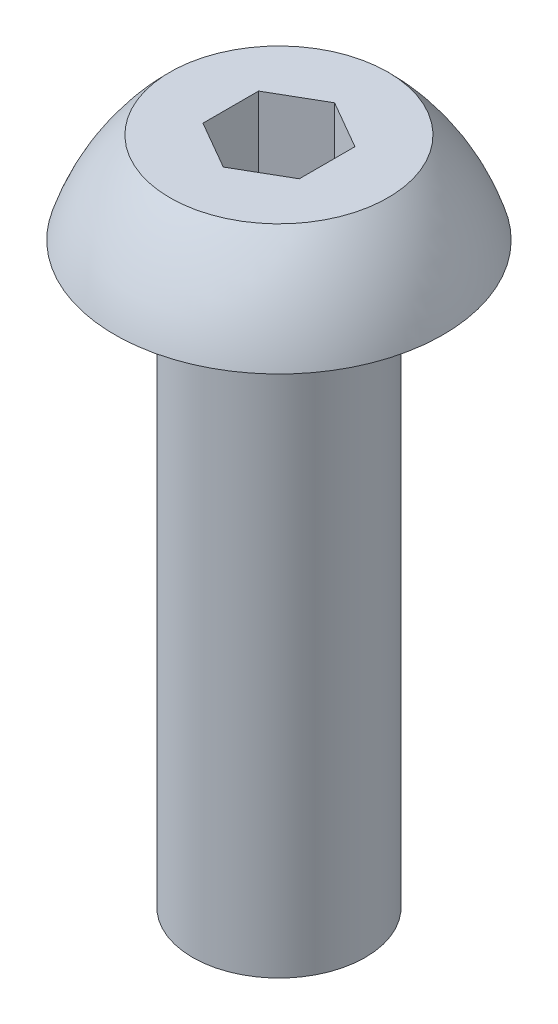
ISO-10303-21;
HEADER;
FILE_DESCRIPTION(('STEP AP214'),'2;1');
FILE_NAME('part.step','',(''),(''),'','','');
FILE_SCHEMA(('AUTOMOTIVE_DESIGN { 1 0 10303 214 1 1 1 1 }'));
ENDSEC;
DATA;
#1=APPLICATION_CONTEXT('core data for automotive mechanical design processes');
#2=APPLICATION_PROTOCOL_DEFINITION('international standard','automotive_design',2000,#1);
#3=PRODUCT_CONTEXT('',#1,'mechanical');
#4=PRODUCT('Part','Part','',(#3));
#5=PRODUCT_RELATED_PRODUCT_CATEGORY('part','',(#4));
#6=PRODUCT_DEFINITION_FORMATION('','',#4);
#7=PRODUCT_DEFINITION_CONTEXT('part definition',#1,'design');
#8=PRODUCT_DEFINITION('design','',#6,#7);
#9=PRODUCT_DEFINITION_SHAPE('','',#8);
#10=(LENGTH_UNIT() NAMED_UNIT(*) SI_UNIT(.MILLI.,.METRE.));
#11=(NAMED_UNIT(*) PLANE_ANGLE_UNIT() SI_UNIT($,.RADIAN.));
#12=(NAMED_UNIT(*) SI_UNIT($,.STERADIAN.) SOLID_ANGLE_UNIT());
#13=UNCERTAINTY_MEASURE_WITH_UNIT(LENGTH_MEASURE(1.E-05),#10,'distance_accuracy_value','');
#14=(GEOMETRIC_REPRESENTATION_CONTEXT(3) GLOBAL_UNCERTAINTY_ASSIGNED_CONTEXT((#13)) GLOBAL_UNIT_ASSIGNED_CONTEXT((#10,
#11,#12)) REPRESENTATION_CONTEXT('',''));
#15=CARTESIAN_POINT('',(0.,0.,0.));
#16=DIRECTION('',(0.,0.,1.));
#17=DIRECTION('',(1.,0.,0.));
#18=AXIS2_PLACEMENT_3D('',#15,#16,#17);
#19=CARTESIAN_POINT('',(0.,-9.525,0.));
#20=DIRECTION('',(0.,-1.,0.));
#21=DIRECTION('',(0.,0.,-1.));
#22=AXIS2_PLACEMENT_3D('',#19,#20,#21);
#23=CYLINDRICAL_SURFACE('',#22,1.4224);
#24=CARTESIAN_POINT('',(0.,-9.525,0.));
#25=DIRECTION('',(0.,-1.,0.));
#26=DIRECTION('',(0.,0.,-1.));
#27=AXIS2_PLACEMENT_3D('',#24,#25,#26);
#28=CIRCLE('',#27,1.4224);
#29=CARTESIAN_POINT('',(0.,-9.525,-1.4224));
#30=VERTEX_POINT('',#29);
#31=EDGE_CURVE('E133',#30,#30,#28,.T.);
#32=ORIENTED_EDGE('',*,*,#31,.F.);
#33=EDGE_LOOP('',(#32));
#34=FACE_BOUND('',#33,.T.);
#35=CARTESIAN_POINT('',(0.,0.,0.));
#36=DIRECTION('',(0.,-1.,0.));
#37=DIRECTION('',(0.,0.,-1.));
#38=AXIS2_PLACEMENT_3D('',#35,#36,#37);
#39=CIRCLE('',#38,1.4224);
#40=CARTESIAN_POINT('',(0.,0.,-1.4224));
#41=VERTEX_POINT('',#40);
#42=EDGE_CURVE('E11',#41,#41,#39,.T.);
#43=ORIENTED_EDGE('',*,*,#42,.T.);
#44=EDGE_LOOP('',(#43));
#45=FACE_BOUND('',#44,.T.);
#46=ADVANCED_FACE('F32',(#34,#45),#23,.T.);
#47=CARTESIAN_POINT('',(-1.4224,0.,0.));
#48=DIRECTION('',(0.,1.,0.));
#49=DIRECTION('',(0.,0.,1.));
#50=AXIS2_PLACEMENT_3D('',#47,#48,#49);
#51=PLANE('',#50);
#52=ORIENTED_EDGE('',*,*,#42,.F.);
#53=EDGE_LOOP('',(#52));
#54=FACE_BOUND('',#53,.T.);
#55=CARTESIAN_POINT('',(0.,0.,0.));
#56=DIRECTION('',(0.,-1.,0.));
#57=DIRECTION('',(0.,0.,-1.));
#58=AXIS2_PLACEMENT_3D('',#55,#56,#57);
#59=CIRCLE('',#58,2.7051);
#60=CARTESIAN_POINT('',(0.,0.,-2.7051));
#61=VERTEX_POINT('',#60);
#62=EDGE_CURVE('E39',#61,#61,#59,.T.);
#63=ORIENTED_EDGE('',*,*,#62,.T.);
#64=EDGE_LOOP('',(#63));
#65=FACE_BOUND('',#64,.T.);
#66=ADVANCED_FACE('F146',(#54,#65),#51,.F.);
#67=CARTESIAN_POINT('',(0.,-1.04271365415663,0.));
#68=DIRECTION('',(0.,-1.,0.));
#69=DIRECTION('',(0.,0.,-1.));
#70=AXIS2_PLACEMENT_3D('',#67,#68,#69);
#71=DEGENERATE_TOROIDAL_SURFACE('',#70,0.700107002516782,3.5612759643917,.F.);
#72=ORIENTED_EDGE('',*,*,#62,.F.);
#73=EDGE_LOOP('',(#72));
#74=FACE_BOUND('',#73,.T.);
#75=CARTESIAN_POINT('',(0.,1.4986,0.));
#76=DIRECTION('',(0.,-1.,0.));
#77=DIRECTION('',(0.,0.,-1.));
#78=AXIS2_PLACEMENT_3D('',#75,#76,#77);
#79=CIRCLE('',#78,1.7947700296736);
#80=CARTESIAN_POINT('',(0.,1.4986,-1.7947700296736));
#81=VERTEX_POINT('',#80);
#82=EDGE_CURVE('E141',#81,#81,#79,.T.);
#83=ORIENTED_EDGE('',*,*,#82,.T.);
#84=EDGE_LOOP('',(#83));
#85=FACE_BOUND('',#84,.T.);
#86=ADVANCED_FACE('F148',(#74,#85),#71,.F.);
#87=CARTESIAN_POINT('',(0.,1.4986,0.));
#88=DIRECTION('',(0.,-1.,0.));
#89=DIRECTION('',(0.,0.,-1.));
#90=AXIS2_PLACEMENT_3D('',#87,#88,#89);
#91=PLANE('',#90);
#92=DIRECTION('',(0.,0.,1.));
#93=VECTOR('',#92,1.);
#94=CARTESIAN_POINT('',(-0.79375,1.4986,-0.458271776169265));
#95=LINE('',#94,#93);
#96=CARTESIAN_POINT('',(-0.79375,1.4986,-0.458271776169265));
#97=VERTEX_POINT('',#96);
#98=CARTESIAN_POINT('',(-0.79375,1.4986,0.458271776169266));
#99=VERTEX_POINT('',#98);
#100=EDGE_CURVE('E120',#97,#99,#95,.T.);
#101=ORIENTED_EDGE('',*,*,#100,.F.);
#102=DIRECTION('',(-0.866025403784438,0.,0.5));
#103=VECTOR('',#102,1.);
#104=CARTESIAN_POINT('',(0.,1.4986,-0.916543552338531));
#105=LINE('',#104,#103);
#106=CARTESIAN_POINT('',(0.,1.4986,-0.916543552338531));
#107=VERTEX_POINT('',#106);
#108=EDGE_CURVE('E46',#107,#97,#105,.T.);
#109=ORIENTED_EDGE('',*,*,#108,.F.);
#110=DIRECTION('',(-0.866025403784439,0.,-0.5));
#111=VECTOR('',#110,1.);
#112=CARTESIAN_POINT('',(0.79375,1.4986,-0.458271776169266));
#113=LINE('',#112,#111);
#114=CARTESIAN_POINT('',(0.79375,1.4986,-0.458271776169266));
#115=VERTEX_POINT('',#114);
#116=EDGE_CURVE('E129',#115,#107,#113,.T.);
#117=ORIENTED_EDGE('',*,*,#116,.F.);
#118=DIRECTION('',(0.,0.,-1.));
#119=VECTOR('',#118,1.);
#120=CARTESIAN_POINT('',(0.79375,1.4986,0.458271776169265));
#121=LINE('',#120,#119);
#122=CARTESIAN_POINT('',(0.79375,1.4986,0.458271776169265));
#123=VERTEX_POINT('',#122);
#124=EDGE_CURVE('E127',#123,#115,#121,.T.);
#125=ORIENTED_EDGE('',*,*,#124,.F.);
#126=DIRECTION('',(0.866025403784439,0.,-0.5));
#127=VECTOR('',#126,1.);
#128=CARTESIAN_POINT('',(0.,1.4986,0.916543552338531));
#129=LINE('',#128,#127);
#130=CARTESIAN_POINT('',(0.,1.4986,0.916543552338531));
#131=VERTEX_POINT('',#130);
#132=EDGE_CURVE('E94',#131,#123,#129,.T.);
#133=ORIENTED_EDGE('',*,*,#132,.F.);
#134=DIRECTION('',(0.866025403784439,0.,0.5));
#135=VECTOR('',#134,1.);
#136=CARTESIAN_POINT('',(-0.79375,1.4986,0.458271776169266));
#137=LINE('',#136,#135);
#138=EDGE_CURVE('E123',#99,#131,#137,.T.);
#139=ORIENTED_EDGE('',*,*,#138,.F.);
#140=EDGE_LOOP('',(#101,#109,#117,#125,#133,#139));
#141=FACE_BOUND('',#140,.T.);
#142=ORIENTED_EDGE('',*,*,#82,.F.);
#143=EDGE_LOOP('',(#142));
#144=FACE_BOUND('',#143,.T.);
#145=ADVANCED_FACE('F151',(#141,#144),#91,.F.);
#146=CARTESIAN_POINT('',(-1.4224,-9.525,0.));
#147=DIRECTION('',(0.,1.,0.));
#148=DIRECTION('',(0.,0.,1.));
#149=AXIS2_PLACEMENT_3D('',#146,#147,#148);
#150=PLANE('',#149);
#151=ORIENTED_EDGE('',*,*,#31,.T.);
#152=EDGE_LOOP('',(#151));
#153=FACE_BOUND('',#152,.T.);
#154=ADVANCED_FACE('F156',(#153),#150,.F.);
#155=CARTESIAN_POINT('',(0.,0.2286,-0.916543552338531));
#156=DIRECTION('',(-0.5,0.,-0.866025403784438));
#157=DIRECTION('',(-0.866025403784439,0.,0.5));
#158=AXIS2_PLACEMENT_3D('',#155,#156,#157);
#159=PLANE('',#158);
#160=ORIENTED_EDGE('',*,*,#108,.T.);
#161=DIRECTION('',(0.,1.,0.));
#162=VECTOR('',#161,1.);
#163=CARTESIAN_POINT('',(-0.79375,0.2286,-0.458271776169265));
#164=LINE('',#163,#162);
#165=CARTESIAN_POINT('',(-0.79375,0.2286,-0.458271776169265));
#166=VERTEX_POINT('',#165);
#167=EDGE_CURVE('E76',#166,#97,#164,.T.);
#168=ORIENTED_EDGE('',*,*,#167,.F.);
#169=DIRECTION('',(-0.866025403784438,0.,0.5));
#170=VECTOR('',#169,1.);
#171=CARTESIAN_POINT('',(0.,0.2286,-0.916543552338531));
#172=LINE('',#171,#170);
#173=CARTESIAN_POINT('',(0.,0.2286,-0.916543552338531));
#174=VERTEX_POINT('',#173);
#175=EDGE_CURVE('E131',#174,#166,#172,.T.);
#176=ORIENTED_EDGE('',*,*,#175,.F.);
#177=DIRECTION('',(0.,1.,0.));
#178=VECTOR('',#177,1.);
#179=CARTESIAN_POINT('',(0.,0.2286,-0.916543552338531));
#180=LINE('',#179,#178);
#181=EDGE_CURVE('E54',#174,#107,#180,.T.);
#182=ORIENTED_EDGE('',*,*,#181,.T.);
#183=EDGE_LOOP('',(#160,#168,#176,#182));
#184=FACE_BOUND('',#183,.T.);
#185=ADVANCED_FACE('F162',(#184),#159,.F.);
#186=CARTESIAN_POINT('',(0.79375,0.2286,-0.458271776169266));
#187=DIRECTION('',(0.5,0.,-0.866025403784439));
#188=DIRECTION('',(-0.866025403784439,0.,-0.5));
#189=AXIS2_PLACEMENT_3D('',#186,#187,#188);
#190=PLANE('',#189);
#191=ORIENTED_EDGE('',*,*,#116,.T.);
#192=ORIENTED_EDGE('',*,*,#181,.F.);
#193=DIRECTION('',(-0.866025403784439,0.,-0.5));
#194=VECTOR('',#193,1.);
#195=CARTESIAN_POINT('',(0.79375,0.2286,-0.458271776169266));
#196=LINE('',#195,#194);
#197=CARTESIAN_POINT('',(0.79375,0.2286,-0.458271776169266));
#198=VERTEX_POINT('',#197);
#199=EDGE_CURVE('E106',#198,#174,#196,.T.);
#200=ORIENTED_EDGE('',*,*,#199,.F.);
#201=DIRECTION('',(0.,1.,0.));
#202=VECTOR('',#201,1.);
#203=CARTESIAN_POINT('',(0.79375,0.2286,-0.458271776169266));
#204=LINE('',#203,#202);
#205=EDGE_CURVE('E98',#198,#115,#204,.T.);
#206=ORIENTED_EDGE('',*,*,#205,.T.);
#207=EDGE_LOOP('',(#191,#192,#200,#206));
#208=FACE_BOUND('',#207,.T.);
#209=ADVANCED_FACE('F200',(#208),#190,.F.);
#210=CARTESIAN_POINT('',(0.79375,0.2286,0.458271776169265));
#211=DIRECTION('',(1.,0.,0.));
#212=DIRECTION('',(0.,0.,-1.));
#213=AXIS2_PLACEMENT_3D('',#210,#211,#212);
#214=PLANE('',#213);
#215=ORIENTED_EDGE('',*,*,#124,.T.);
#216=ORIENTED_EDGE('',*,*,#205,.F.);
#217=DIRECTION('',(0.,0.,-1.));
#218=VECTOR('',#217,1.);
#219=CARTESIAN_POINT('',(0.79375,0.2286,0.458271776169265));
#220=LINE('',#219,#218);
#221=CARTESIAN_POINT('',(0.79375,0.2286,0.458271776169265));
#222=VERTEX_POINT('',#221);
#223=EDGE_CURVE('E102',#222,#198,#220,.T.);
#224=ORIENTED_EDGE('',*,*,#223,.F.);
#225=DIRECTION('',(0.,1.,0.));
#226=VECTOR('',#225,1.);
#227=CARTESIAN_POINT('',(0.79375,0.2286,0.458271776169265));
#228=LINE('',#227,#226);
#229=EDGE_CURVE('E87',#222,#123,#228,.T.);
#230=ORIENTED_EDGE('',*,*,#229,.T.);
#231=EDGE_LOOP('',(#215,#216,#224,#230));
#232=FACE_BOUND('',#231,.T.);
#233=ADVANCED_FACE('F103',(#232),#214,.F.);
#234=CARTESIAN_POINT('',(0.,0.2286,0.916543552338531));
#235=DIRECTION('',(0.5,0.,0.866025403784439));
#236=DIRECTION('',(0.866025403784439,0.,-0.5));
#237=AXIS2_PLACEMENT_3D('',#234,#235,#236);
#238=PLANE('',#237);
#239=ORIENTED_EDGE('',*,*,#132,.T.);
#240=ORIENTED_EDGE('',*,*,#229,.F.);
#241=DIRECTION('',(0.866025403784439,0.,-0.5));
#242=VECTOR('',#241,1.);
#243=CARTESIAN_POINT('',(0.,0.2286,0.916543552338531));
#244=LINE('',#243,#242);
#245=CARTESIAN_POINT('',(0.,0.2286,0.916543552338531));
#246=VERTEX_POINT('',#245);
#247=EDGE_CURVE('E91',#246,#222,#244,.T.);
#248=ORIENTED_EDGE('',*,*,#247,.F.);
#249=DIRECTION('',(0.,1.,0.));
#250=VECTOR('',#249,1.);
#251=CARTESIAN_POINT('',(0.,0.2286,0.916543552338531));
#252=LINE('',#251,#250);
#253=EDGE_CURVE('E99',#246,#131,#252,.T.);
#254=ORIENTED_EDGE('',*,*,#253,.T.);
#255=EDGE_LOOP('',(#239,#240,#248,#254));
#256=FACE_BOUND('',#255,.T.);
#257=ADVANCED_FACE('F89',(#256),#238,.F.);
#258=CARTESIAN_POINT('',(-0.79375,0.2286,0.458271776169266));
#259=DIRECTION('',(-0.5,0.,0.866025403784439));
#260=DIRECTION('',(0.866025403784439,0.,0.5));
#261=AXIS2_PLACEMENT_3D('',#258,#259,#260);
#262=PLANE('',#261);
#263=ORIENTED_EDGE('',*,*,#138,.T.);
#264=ORIENTED_EDGE('',*,*,#253,.F.);
#265=DIRECTION('',(0.866025403784439,0.,0.5));
#266=VECTOR('',#265,1.);
#267=CARTESIAN_POINT('',(-0.79375,0.2286,0.458271776169266));
#268=LINE('',#267,#266);
#269=CARTESIAN_POINT('',(-0.79375,0.2286,0.458271776169266));
#270=VERTEX_POINT('',#269);
#271=EDGE_CURVE('E112',#270,#246,#268,.T.);
#272=ORIENTED_EDGE('',*,*,#271,.F.);
#273=DIRECTION('',(0.,1.,0.));
#274=VECTOR('',#273,1.);
#275=CARTESIAN_POINT('',(-0.79375,0.2286,0.458271776169266));
#276=LINE('',#275,#274);
#277=EDGE_CURVE('E136',#270,#99,#276,.T.);
#278=ORIENTED_EDGE('',*,*,#277,.T.);
#279=EDGE_LOOP('',(#263,#264,#272,#278));
#280=FACE_BOUND('',#279,.T.);
#281=ADVANCED_FACE('F225',(#280),#262,.F.);
#282=CARTESIAN_POINT('',(-0.79375,0.2286,-0.458271776169265));
#283=DIRECTION('',(-1.,0.,0.));
#284=DIRECTION('',(0.,0.,1.));
#285=AXIS2_PLACEMENT_3D('',#282,#283,#284);
#286=PLANE('',#285);
#287=ORIENTED_EDGE('',*,*,#100,.T.);
#288=ORIENTED_EDGE('',*,*,#277,.F.);
#289=DIRECTION('',(0.,0.,1.));
#290=VECTOR('',#289,1.);
#291=CARTESIAN_POINT('',(-0.79375,0.2286,-0.458271776169265));
#292=LINE('',#291,#290);
#293=EDGE_CURVE('E114',#166,#270,#292,.T.);
#294=ORIENTED_EDGE('',*,*,#293,.F.);
#295=ORIENTED_EDGE('',*,*,#167,.T.);
#296=EDGE_LOOP('',(#287,#288,#294,#295));
#297=FACE_BOUND('',#296,.T.);
#298=ADVANCED_FACE('F234',(#297),#286,.F.);
#299=CARTESIAN_POINT('',(0.,0.2286,0.));
#300=DIRECTION('',(0.,1.,0.));
#301=DIRECTION('',(0.,0.,1.));
#302=AXIS2_PLACEMENT_3D('',#299,#300,#301);
#303=PLANE('',#302);
#304=ORIENTED_EDGE('',*,*,#175,.T.);
#305=ORIENTED_EDGE('',*,*,#293,.T.);
#306=ORIENTED_EDGE('',*,*,#271,.T.);
#307=ORIENTED_EDGE('',*,*,#247,.T.);
#308=ORIENTED_EDGE('',*,*,#223,.T.);
#309=ORIENTED_EDGE('',*,*,#199,.T.);
#310=EDGE_LOOP('',(#304,#305,#306,#307,#308,#309));
#311=FACE_BOUND('',#310,.T.);
#312=ADVANCED_FACE('F109',(#311),#303,.T.);
#313=CLOSED_SHELL('',(#46,#66,#86,#145,#154,#185,#209,#233,#257,#281,#298,#312));
#314=MANIFOLD_SOLID_BREP('B2',#313);
#315=ADVANCED_BREP_SHAPE_REPRESENTATION('',(#18,#314),#14);
#316=SHAPE_DEFINITION_REPRESENTATION(#9,#315);
ENDSEC;
END-ISO-10303-21;
